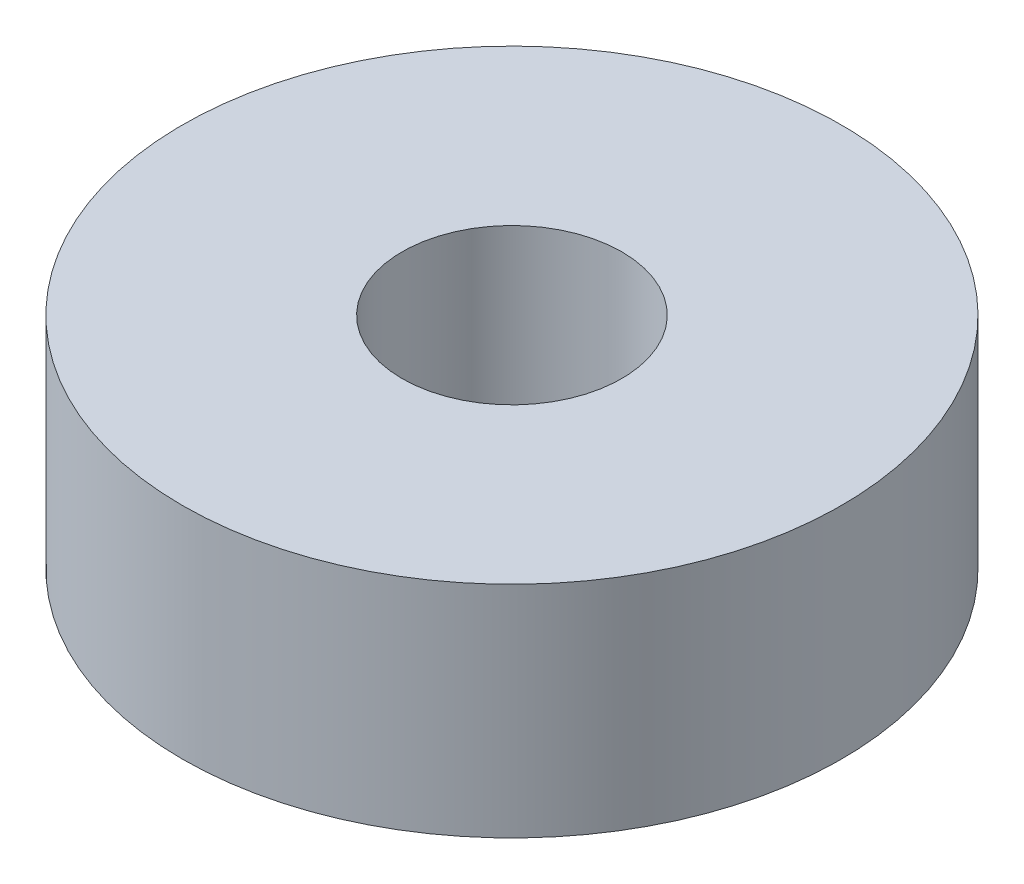
ISO-10303-21;
HEADER;
FILE_DESCRIPTION(('STEP AP214'),'2;1');
FILE_NAME('part.step','',(''),(''),'','','');
FILE_SCHEMA(('AUTOMOTIVE_DESIGN { 1 0 10303 214 1 1 1 1 }'));
ENDSEC;
DATA;
#1=APPLICATION_CONTEXT('core data for automotive mechanical design processes');
#2=APPLICATION_PROTOCOL_DEFINITION('international standard','automotive_design',2000,#1);
#3=PRODUCT_CONTEXT('',#1,'mechanical');
#4=PRODUCT('Part','Part','',(#3));
#5=PRODUCT_RELATED_PRODUCT_CATEGORY('part','',(#4));
#6=PRODUCT_DEFINITION_FORMATION('','',#4);
#7=PRODUCT_DEFINITION_CONTEXT('part definition',#1,'design');
#8=PRODUCT_DEFINITION('design','',#6,#7);
#9=PRODUCT_DEFINITION_SHAPE('','',#8);
#10=(LENGTH_UNIT() NAMED_UNIT(*) SI_UNIT(.MILLI.,.METRE.));
#11=(NAMED_UNIT(*) PLANE_ANGLE_UNIT() SI_UNIT($,.RADIAN.));
#12=(NAMED_UNIT(*) SI_UNIT($,.STERADIAN.) SOLID_ANGLE_UNIT());
#13=UNCERTAINTY_MEASURE_WITH_UNIT(LENGTH_MEASURE(1.E-05),#10,'distance_accuracy_value','');
#14=(GEOMETRIC_REPRESENTATION_CONTEXT(3) GLOBAL_UNCERTAINTY_ASSIGNED_CONTEXT((#13)) GLOBAL_UNIT_ASSIGNED_CONTEXT((#10,
#11,#12)) REPRESENTATION_CONTEXT('',''));
#15=CARTESIAN_POINT('',(0.,0.,0.));
#16=DIRECTION('',(0.,0.,1.));
#17=DIRECTION('',(1.,0.,0.));
#18=AXIS2_PLACEMENT_3D('',#15,#16,#17);
#19=CARTESIAN_POINT('',(0.,4.,0.));
#20=DIRECTION('',(0.,1.,0.));
#21=DIRECTION('',(0.,0.,1.));
#22=AXIS2_PLACEMENT_3D('',#19,#20,#21);
#23=PLANE('',#22);
#24=CARTESIAN_POINT('',(0.,4.,0.));
#25=DIRECTION('',(0.,1.,0.));
#26=DIRECTION('',(0.,0.,1.));
#27=AXIS2_PLACEMENT_3D('',#24,#25,#26);
#28=CIRCLE('',#27,6.);
#29=CARTESIAN_POINT('',(0.,4.,6.));
#30=VERTEX_POINT('',#29);
#31=EDGE_CURVE('E10',#30,#30,#28,.T.);
#32=ORIENTED_EDGE('',*,*,#31,.T.);
#33=EDGE_LOOP('',(#32));
#34=FACE_BOUND('',#33,.T.);
#35=CARTESIAN_POINT('',(0.,4.,0.));
#36=DIRECTION('',(0.,1.,0.));
#37=DIRECTION('',(0.,0.,1.));
#38=AXIS2_PLACEMENT_3D('',#35,#36,#37);
#39=CIRCLE('',#38,2.);
#40=CARTESIAN_POINT('',(0.,4.,2.));
#41=VERTEX_POINT('',#40);
#42=EDGE_CURVE('E48',#41,#41,#39,.T.);
#43=ORIENTED_EDGE('',*,*,#42,.F.);
#44=EDGE_LOOP('',(#43));
#45=FACE_BOUND('',#44,.T.);
#46=ADVANCED_FACE('F37',(#34,#45),#23,.T.);
#47=CARTESIAN_POINT('',(0.,0.,0.));
#48=DIRECTION('',(0.,1.,0.));
#49=DIRECTION('',(0.,0.,1.));
#50=AXIS2_PLACEMENT_3D('',#47,#48,#49);
#51=PLANE('',#50);
#52=CARTESIAN_POINT('',(0.,0.,0.));
#53=DIRECTION('',(0.,1.,0.));
#54=DIRECTION('',(0.,0.,1.));
#55=AXIS2_PLACEMENT_3D('',#52,#53,#54);
#56=CIRCLE('',#55,6.);
#57=CARTESIAN_POINT('',(0.,0.,6.));
#58=VERTEX_POINT('',#57);
#59=EDGE_CURVE('E41',#58,#58,#56,.T.);
#60=ORIENTED_EDGE('',*,*,#59,.F.);
#61=EDGE_LOOP('',(#60));
#62=FACE_BOUND('',#61,.T.);
#63=CARTESIAN_POINT('',(0.,0.,0.));
#64=DIRECTION('',(0.,1.,0.));
#65=DIRECTION('',(0.,0.,1.));
#66=AXIS2_PLACEMENT_3D('',#63,#64,#65);
#67=CIRCLE('',#66,2.);
#68=CARTESIAN_POINT('',(0.,0.,2.));
#69=VERTEX_POINT('',#68);
#70=EDGE_CURVE('E50',#69,#69,#67,.T.);
#71=ORIENTED_EDGE('',*,*,#70,.T.);
#72=EDGE_LOOP('',(#71));
#73=FACE_BOUND('',#72,.T.);
#74=ADVANCED_FACE('F60',(#62,#73),#51,.F.);
#75=CARTESIAN_POINT('',(0.,4.,0.));
#76=DIRECTION('',(0.,-1.,0.));
#77=DIRECTION('',(0.,0.,-1.));
#78=AXIS2_PLACEMENT_3D('',#75,#76,#77);
#79=CYLINDRICAL_SURFACE('',#78,6.);
#80=ORIENTED_EDGE('',*,*,#31,.F.);
#81=EDGE_LOOP('',(#80));
#82=FACE_BOUND('',#81,.T.);
#83=ORIENTED_EDGE('',*,*,#59,.T.);
#84=EDGE_LOOP('',(#83));
#85=FACE_BOUND('',#84,.T.);
#86=ADVANCED_FACE('F39',(#82,#85),#79,.T.);
#87=CARTESIAN_POINT('',(0.,4.,0.));
#88=DIRECTION('',(0.,-1.,0.));
#89=DIRECTION('',(0.,0.,-1.));
#90=AXIS2_PLACEMENT_3D('',#87,#88,#89);
#91=CYLINDRICAL_SURFACE('',#90,2.);
#92=ORIENTED_EDGE('',*,*,#42,.T.);
#93=EDGE_LOOP('',(#92));
#94=FACE_BOUND('',#93,.T.);
#95=ORIENTED_EDGE('',*,*,#70,.F.);
#96=EDGE_LOOP('',(#95));
#97=FACE_BOUND('',#96,.T.);
#98=ADVANCED_FACE('F56',(#94,#97),#91,.F.);
#99=CLOSED_SHELL('',(#46,#74,#86,#98));
#100=MANIFOLD_SOLID_BREP('B2',#99);
#101=ADVANCED_BREP_SHAPE_REPRESENTATION('',(#18,#100),#14);
#102=SHAPE_DEFINITION_REPRESENTATION(#9,#101);
ENDSEC;
END-ISO-10303-21;
